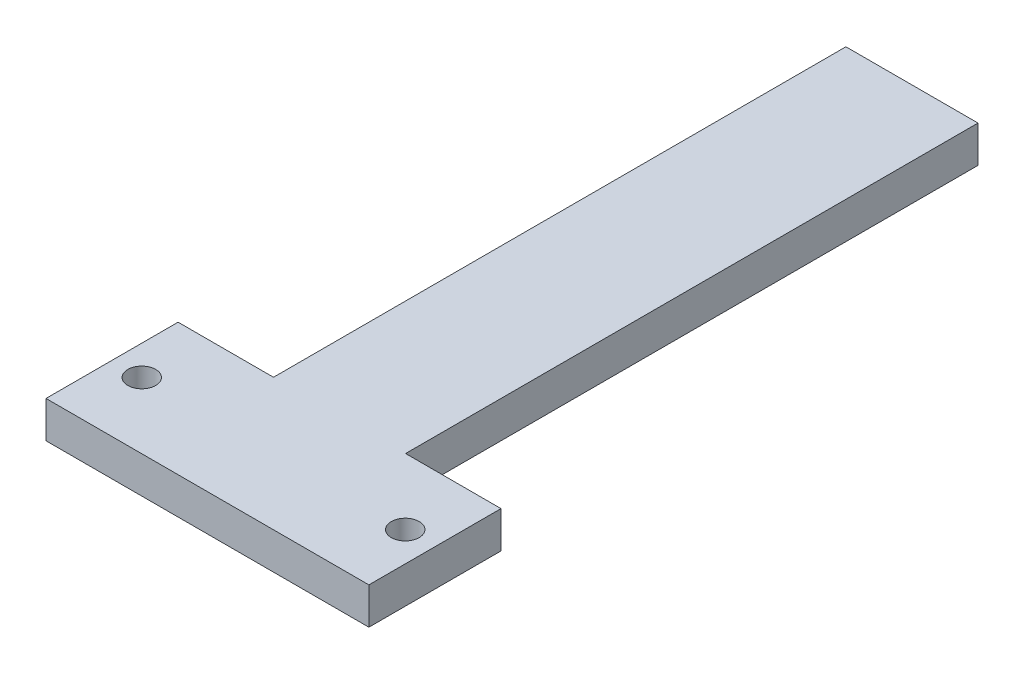
ISO-10303-21;
HEADER;
FILE_DESCRIPTION(('STEP AP214'),'2;1');
FILE_NAME('part.step','',(''),(''),'','','');
FILE_SCHEMA(('AUTOMOTIVE_DESIGN { 1 0 10303 214 1 1 1 1 }'));
ENDSEC;
DATA;
#1=APPLICATION_CONTEXT('core data for automotive mechanical design processes');
#2=APPLICATION_PROTOCOL_DEFINITION('international standard','automotive_design',2000,#1);
#3=PRODUCT_CONTEXT('',#1,'mechanical');
#4=PRODUCT('Part','Part','',(#3));
#5=PRODUCT_RELATED_PRODUCT_CATEGORY('part','',(#4));
#6=PRODUCT_DEFINITION_FORMATION('','',#4);
#7=PRODUCT_DEFINITION_CONTEXT('part definition',#1,'design');
#8=PRODUCT_DEFINITION('design','',#6,#7);
#9=PRODUCT_DEFINITION_SHAPE('','',#8);
#10=(LENGTH_UNIT() NAMED_UNIT(*) SI_UNIT(.MILLI.,.METRE.));
#11=(NAMED_UNIT(*) PLANE_ANGLE_UNIT() SI_UNIT($,.RADIAN.));
#12=(NAMED_UNIT(*) SI_UNIT($,.STERADIAN.) SOLID_ANGLE_UNIT());
#13=UNCERTAINTY_MEASURE_WITH_UNIT(LENGTH_MEASURE(1.E-05),#10,'distance_accuracy_value','');
#14=(GEOMETRIC_REPRESENTATION_CONTEXT(3) GLOBAL_UNCERTAINTY_ASSIGNED_CONTEXT((#13)) GLOBAL_UNIT_ASSIGNED_CONTEXT((#10,
#11,#12)) REPRESENTATION_CONTEXT('',''));
#15=CARTESIAN_POINT('',(0.,0.,0.));
#16=DIRECTION('',(0.,0.,1.));
#17=DIRECTION('',(1.,0.,0.));
#18=AXIS2_PLACEMENT_3D('',#15,#16,#17);
#19=CARTESIAN_POINT('',(-11.43,6.35,0.));
#20=DIRECTION('',(-1.,0.,0.));
#21=DIRECTION('',(0.,0.,1.));
#22=AXIS2_PLACEMENT_3D('',#19,#20,#21);
#23=PLANE('',#22);
#24=DIRECTION('',(0.,0.,-1.));
#25=VECTOR('',#24,1.);
#26=CARTESIAN_POINT('',(-11.43,0.,0.));
#27=LINE('',#26,#25);
#28=CARTESIAN_POINT('',(-11.43,0.,-11.43));
#29=VERTEX_POINT('',#28);
#30=CARTESIAN_POINT('',(-11.43,0.,-110.49));
#31=VERTEX_POINT('',#30);
#32=EDGE_CURVE('E142',#29,#31,#27,.T.);
#33=ORIENTED_EDGE('',*,*,#32,.F.);
#34=DIRECTION('',(0.,-1.,0.));
#35=VECTOR('',#34,1.);
#36=CARTESIAN_POINT('',(-11.43,6.35,-11.43));
#37=LINE('',#36,#35);
#38=CARTESIAN_POINT('',(-11.43,6.35,-11.43));
#39=VERTEX_POINT('',#38);
#40=EDGE_CURVE('E11',#39,#29,#37,.T.);
#41=ORIENTED_EDGE('',*,*,#40,.F.);
#42=DIRECTION('',(0.,0.,-1.));
#43=VECTOR('',#42,1.);
#44=CARTESIAN_POINT('',(-11.43,6.35,0.));
#45=LINE('',#44,#43);
#46=CARTESIAN_POINT('',(-11.43,6.35,-110.49));
#47=VERTEX_POINT('',#46);
#48=EDGE_CURVE('E166',#39,#47,#45,.T.);
#49=ORIENTED_EDGE('',*,*,#48,.T.);
#50=DIRECTION('',(0.,-1.,0.));
#51=VECTOR('',#50,1.);
#52=CARTESIAN_POINT('',(-11.43,6.35,-110.49));
#53=LINE('',#52,#51);
#54=EDGE_CURVE('E54',#47,#31,#53,.T.);
#55=ORIENTED_EDGE('',*,*,#54,.T.);
#56=EDGE_LOOP('',(#33,#41,#49,#55));
#57=FACE_BOUND('',#56,.T.);
#58=ADVANCED_FACE('F38',(#57),#23,.T.);
#59=CARTESIAN_POINT('',(0.,6.35,-11.43));
#60=DIRECTION('',(0.,0.,1.));
#61=DIRECTION('',(1.,0.,0.));
#62=AXIS2_PLACEMENT_3D('',#59,#60,#61);
#63=PLANE('',#62);
#64=DIRECTION('',(-1.,0.,0.));
#65=VECTOR('',#64,1.);
#66=CARTESIAN_POINT('',(0.,0.,-11.43));
#67=LINE('',#66,#65);
#68=CARTESIAN_POINT('',(-27.94,0.,-11.43));
#69=VERTEX_POINT('',#68);
#70=EDGE_CURVE('E144',#29,#69,#67,.T.);
#71=ORIENTED_EDGE('',*,*,#70,.T.);
#72=DIRECTION('',(0.,-1.,0.));
#73=VECTOR('',#72,1.);
#74=CARTESIAN_POINT('',(-27.94,6.35,-11.43));
#75=LINE('',#74,#73);
#76=CARTESIAN_POINT('',(-27.94,6.35,-11.43));
#77=VERTEX_POINT('',#76);
#78=EDGE_CURVE('E46',#77,#69,#75,.T.);
#79=ORIENTED_EDGE('',*,*,#78,.F.);
#80=DIRECTION('',(-1.,0.,0.));
#81=VECTOR('',#80,1.);
#82=CARTESIAN_POINT('',(0.,6.35,-11.43));
#83=LINE('',#82,#81);
#84=EDGE_CURVE('E119',#39,#77,#83,.T.);
#85=ORIENTED_EDGE('',*,*,#84,.F.);
#86=ORIENTED_EDGE('',*,*,#40,.T.);
#87=EDGE_LOOP('',(#71,#79,#85,#86));
#88=FACE_BOUND('',#87,.T.);
#89=ADVANCED_FACE('F182',(#88),#63,.F.);
#90=CARTESIAN_POINT('',(-27.94,6.35,0.));
#91=DIRECTION('',(-1.,0.,0.));
#92=DIRECTION('',(0.,0.,1.));
#93=AXIS2_PLACEMENT_3D('',#90,#91,#92);
#94=PLANE('',#93);
#95=DIRECTION('',(0.,0.,-1.));
#96=VECTOR('',#95,1.);
#97=CARTESIAN_POINT('',(-27.94,0.,0.));
#98=LINE('',#97,#96);
#99=CARTESIAN_POINT('',(-27.94,0.,11.43));
#100=VERTEX_POINT('',#99);
#101=EDGE_CURVE('E147',#100,#69,#98,.T.);
#102=ORIENTED_EDGE('',*,*,#101,.F.);
#103=DIRECTION('',(0.,-1.,0.));
#104=VECTOR('',#103,1.);
#105=CARTESIAN_POINT('',(-27.94,6.35,11.43));
#106=LINE('',#105,#104);
#107=CARTESIAN_POINT('',(-27.94,6.35,11.43));
#108=VERTEX_POINT('',#107);
#109=EDGE_CURVE('E172',#108,#100,#106,.T.);
#110=ORIENTED_EDGE('',*,*,#109,.F.);
#111=DIRECTION('',(0.,0.,-1.));
#112=VECTOR('',#111,1.);
#113=CARTESIAN_POINT('',(-27.94,6.35,0.));
#114=LINE('',#113,#112);
#115=EDGE_CURVE('E179',#108,#77,#114,.T.);
#116=ORIENTED_EDGE('',*,*,#115,.T.);
#117=ORIENTED_EDGE('',*,*,#78,.T.);
#118=EDGE_LOOP('',(#102,#110,#116,#117));
#119=FACE_BOUND('',#118,.T.);
#120=ADVANCED_FACE('F177',(#119),#94,.T.);
#121=CARTESIAN_POINT('',(0.,6.35,11.43));
#122=DIRECTION('',(0.,0.,1.));
#123=DIRECTION('',(1.,0.,0.));
#124=AXIS2_PLACEMENT_3D('',#121,#122,#123);
#125=PLANE('',#124);
#126=DIRECTION('',(-1.,0.,0.));
#127=VECTOR('',#126,1.);
#128=CARTESIAN_POINT('',(0.,0.,11.43));
#129=LINE('',#128,#127);
#130=CARTESIAN_POINT('',(27.94,0.,11.43));
#131=VERTEX_POINT('',#130);
#132=EDGE_CURVE('E150',#131,#100,#129,.T.);
#133=ORIENTED_EDGE('',*,*,#132,.F.);
#134=DIRECTION('',(0.,-1.,0.));
#135=VECTOR('',#134,1.);
#136=CARTESIAN_POINT('',(27.94,6.35,11.43));
#137=LINE('',#136,#135);
#138=CARTESIAN_POINT('',(27.94,6.35,11.43));
#139=VERTEX_POINT('',#138);
#140=EDGE_CURVE('E170',#139,#131,#137,.T.);
#141=ORIENTED_EDGE('',*,*,#140,.F.);
#142=DIRECTION('',(-1.,0.,0.));
#143=VECTOR('',#142,1.);
#144=CARTESIAN_POINT('',(0.,6.35,11.43));
#145=LINE('',#144,#143);
#146=EDGE_CURVE('E191',#139,#108,#145,.T.);
#147=ORIENTED_EDGE('',*,*,#146,.T.);
#148=ORIENTED_EDGE('',*,*,#109,.T.);
#149=EDGE_LOOP('',(#133,#141,#147,#148));
#150=FACE_BOUND('',#149,.T.);
#151=ADVANCED_FACE('F189',(#150),#125,.T.);
#152=CARTESIAN_POINT('',(27.94,6.35,0.));
#153=DIRECTION('',(-1.,0.,0.));
#154=DIRECTION('',(0.,0.,1.));
#155=AXIS2_PLACEMENT_3D('',#152,#153,#154);
#156=PLANE('',#155);
#157=DIRECTION('',(0.,0.,-1.));
#158=VECTOR('',#157,1.);
#159=CARTESIAN_POINT('',(27.94,0.,0.));
#160=LINE('',#159,#158);
#161=CARTESIAN_POINT('',(27.94,0.,-11.43));
#162=VERTEX_POINT('',#161);
#163=EDGE_CURVE('E153',#131,#162,#160,.T.);
#164=ORIENTED_EDGE('',*,*,#163,.T.);
#165=DIRECTION('',(0.,-1.,0.));
#166=VECTOR('',#165,1.);
#167=CARTESIAN_POINT('',(27.94,6.35,-11.43));
#168=LINE('',#167,#166);
#169=CARTESIAN_POINT('',(27.94,6.35,-11.43));
#170=VERTEX_POINT('',#169);
#171=EDGE_CURVE('E127',#170,#162,#168,.T.);
#172=ORIENTED_EDGE('',*,*,#171,.F.);
#173=DIRECTION('',(0.,0.,-1.));
#174=VECTOR('',#173,1.);
#175=CARTESIAN_POINT('',(27.94,6.35,0.));
#176=LINE('',#175,#174);
#177=EDGE_CURVE('E114',#139,#170,#176,.T.);
#178=ORIENTED_EDGE('',*,*,#177,.F.);
#179=ORIENTED_EDGE('',*,*,#140,.T.);
#180=EDGE_LOOP('',(#164,#172,#178,#179));
#181=FACE_BOUND('',#180,.T.);
#182=ADVANCED_FACE('F218',(#181),#156,.F.);
#183=CARTESIAN_POINT('',(11.43,0.,-11.43));
#184=VERTEX_POINT('',#183);
#185=EDGE_CURVE('E124',#162,#184,#67,.T.);
#186=ORIENTED_EDGE('',*,*,#185,.T.);
#187=DIRECTION('',(0.,-1.,0.));
#188=VECTOR('',#187,1.);
#189=CARTESIAN_POINT('',(11.43,6.35,-11.43));
#190=LINE('',#189,#188);
#191=CARTESIAN_POINT('',(11.43,6.35,-11.43));
#192=VERTEX_POINT('',#191);
#193=EDGE_CURVE('E121',#192,#184,#190,.T.);
#194=ORIENTED_EDGE('',*,*,#193,.F.);
#195=EDGE_CURVE('E104',#170,#192,#83,.T.);
#196=ORIENTED_EDGE('',*,*,#195,.F.);
#197=ORIENTED_EDGE('',*,*,#171,.T.);
#198=EDGE_LOOP('',(#186,#194,#196,#197));
#199=FACE_BOUND('',#198,.T.);
#200=ADVANCED_FACE('F122',(#199),#63,.F.);
#201=CARTESIAN_POINT('',(11.43,6.35,0.));
#202=DIRECTION('',(-1.,0.,0.));
#203=DIRECTION('',(0.,0.,1.));
#204=AXIS2_PLACEMENT_3D('',#201,#202,#203);
#205=PLANE('',#204);
#206=DIRECTION('',(0.,0.,-1.));
#207=VECTOR('',#206,1.);
#208=CARTESIAN_POINT('',(11.43,0.,0.));
#209=LINE('',#208,#207);
#210=CARTESIAN_POINT('',(11.43,0.,-110.49));
#211=VERTEX_POINT('',#210);
#212=EDGE_CURVE('E155',#184,#211,#209,.T.);
#213=ORIENTED_EDGE('',*,*,#212,.T.);
#214=DIRECTION('',(0.,-1.,0.));
#215=VECTOR('',#214,1.);
#216=CARTESIAN_POINT('',(11.43,6.35,-110.49));
#217=LINE('',#216,#215);
#218=CARTESIAN_POINT('',(11.43,6.35,-110.49));
#219=VERTEX_POINT('',#218);
#220=EDGE_CURVE('E80',#219,#211,#217,.T.);
#221=ORIENTED_EDGE('',*,*,#220,.F.);
#222=DIRECTION('',(0.,0.,-1.));
#223=VECTOR('',#222,1.);
#224=CARTESIAN_POINT('',(11.43,6.35,0.));
#225=LINE('',#224,#223);
#226=EDGE_CURVE('E111',#192,#219,#225,.T.);
#227=ORIENTED_EDGE('',*,*,#226,.F.);
#228=ORIENTED_EDGE('',*,*,#193,.T.);
#229=EDGE_LOOP('',(#213,#221,#227,#228));
#230=FACE_BOUND('',#229,.T.);
#231=ADVANCED_FACE('F129',(#230),#205,.F.);
#232=CARTESIAN_POINT('',(22.7965,6.35,0.));
#233=DIRECTION('',(0.,-1.,0.));
#234=DIRECTION('',(0.,0.,-1.));
#235=AXIS2_PLACEMENT_3D('',#232,#233,#234);
#236=CYLINDRICAL_SURFACE('',#235,2.413);
#237=CARTESIAN_POINT('',(22.7965,6.35,0.));
#238=DIRECTION('',(0.,1.,0.));
#239=DIRECTION('',(0.,0.,1.));
#240=AXIS2_PLACEMENT_3D('',#237,#238,#239);
#241=CIRCLE('',#240,2.413);
#242=CARTESIAN_POINT('',(22.7965,6.35,2.413));
#243=VERTEX_POINT('',#242);
#244=EDGE_CURVE('E132',#243,#243,#241,.T.);
#245=ORIENTED_EDGE('',*,*,#244,.T.);
#246=EDGE_LOOP('',(#245));
#247=FACE_BOUND('',#246,.T.);
#248=CARTESIAN_POINT('',(22.7965,0.,0.));
#249=DIRECTION('',(0.,1.,0.));
#250=DIRECTION('',(0.,0.,1.));
#251=AXIS2_PLACEMENT_3D('',#248,#249,#250);
#252=CIRCLE('',#251,2.413);
#253=CARTESIAN_POINT('',(22.7965,0.,2.413));
#254=VERTEX_POINT('',#253);
#255=EDGE_CURVE('E160',#254,#254,#252,.T.);
#256=ORIENTED_EDGE('',*,*,#255,.F.);
#257=EDGE_LOOP('',(#256));
#258=FACE_BOUND('',#257,.T.);
#259=ADVANCED_FACE('F197',(#247,#258),#236,.F.);
#260=CARTESIAN_POINT('',(0.,6.35,-110.49));
#261=DIRECTION('',(0.,0.,-1.));
#262=DIRECTION('',(-1.,0.,0.));
#263=AXIS2_PLACEMENT_3D('',#260,#261,#262);
#264=PLANE('',#263);
#265=DIRECTION('',(1.,0.,0.));
#266=VECTOR('',#265,1.);
#267=CARTESIAN_POINT('',(0.,0.,-110.49));
#268=LINE('',#267,#266);
#269=EDGE_CURVE('E157',#31,#211,#268,.T.);
#270=ORIENTED_EDGE('',*,*,#269,.F.);
#271=ORIENTED_EDGE('',*,*,#54,.F.);
#272=DIRECTION('',(1.,0.,0.));
#273=VECTOR('',#272,1.);
#274=CARTESIAN_POINT('',(0.,6.35,-110.49));
#275=LINE('',#274,#273);
#276=EDGE_CURVE('E130',#47,#219,#275,.T.);
#277=ORIENTED_EDGE('',*,*,#276,.T.);
#278=ORIENTED_EDGE('',*,*,#220,.T.);
#279=EDGE_LOOP('',(#270,#271,#277,#278));
#280=FACE_BOUND('',#279,.T.);
#281=ADVANCED_FACE('F194',(#280),#264,.T.);
#282=CARTESIAN_POINT('',(-22.7965,6.35,0.));
#283=DIRECTION('',(0.,-1.,0.));
#284=DIRECTION('',(0.,0.,-1.));
#285=AXIS2_PLACEMENT_3D('',#282,#283,#284);
#286=CYLINDRICAL_SURFACE('',#285,2.413);
#287=CARTESIAN_POINT('',(-22.7965,6.35,0.));
#288=DIRECTION('',(0.,1.,0.));
#289=DIRECTION('',(0.,0.,1.));
#290=AXIS2_PLACEMENT_3D('',#287,#288,#289);
#291=CIRCLE('',#290,2.413);
#292=CARTESIAN_POINT('',(-22.7965,6.35,2.413));
#293=VERTEX_POINT('',#292);
#294=EDGE_CURVE('E139',#293,#293,#291,.T.);
#295=ORIENTED_EDGE('',*,*,#294,.T.);
#296=EDGE_LOOP('',(#295));
#297=FACE_BOUND('',#296,.T.);
#298=CARTESIAN_POINT('',(-22.7965,0.,0.));
#299=DIRECTION('',(0.,1.,0.));
#300=DIRECTION('',(0.,0.,1.));
#301=AXIS2_PLACEMENT_3D('',#298,#299,#300);
#302=CIRCLE('',#301,2.413);
#303=CARTESIAN_POINT('',(-22.7965,0.,2.413));
#304=VERTEX_POINT('',#303);
#305=EDGE_CURVE('E163',#304,#304,#302,.T.);
#306=ORIENTED_EDGE('',*,*,#305,.F.);
#307=EDGE_LOOP('',(#306));
#308=FACE_BOUND('',#307,.T.);
#309=ADVANCED_FACE('F196',(#297,#308),#286,.F.);
#310=CARTESIAN_POINT('',(0.,6.35,0.));
#311=DIRECTION('',(0.,1.,0.));
#312=DIRECTION('',(0.,0.,1.));
#313=AXIS2_PLACEMENT_3D('',#310,#311,#312);
#314=PLANE('',#313);
#315=ORIENTED_EDGE('',*,*,#48,.F.);
#316=ORIENTED_EDGE('',*,*,#84,.T.);
#317=ORIENTED_EDGE('',*,*,#115,.F.);
#318=ORIENTED_EDGE('',*,*,#146,.F.);
#319=ORIENTED_EDGE('',*,*,#177,.T.);
#320=ORIENTED_EDGE('',*,*,#195,.T.);
#321=ORIENTED_EDGE('',*,*,#226,.T.);
#322=ORIENTED_EDGE('',*,*,#276,.F.);
#323=EDGE_LOOP('',(#315,#316,#317,#318,#319,#320,#321,#322));
#324=FACE_BOUND('',#323,.T.);
#325=ORIENTED_EDGE('',*,*,#244,.F.);
#326=EDGE_LOOP('',(#325));
#327=FACE_BOUND('',#326,.T.);
#328=ORIENTED_EDGE('',*,*,#294,.F.);
#329=EDGE_LOOP('',(#328));
#330=FACE_BOUND('',#329,.T.);
#331=ADVANCED_FACE('F107',(#324,#327,#330),#314,.T.);
#332=CARTESIAN_POINT('',(0.,0.,0.));
#333=DIRECTION('',(0.,1.,0.));
#334=DIRECTION('',(0.,0.,1.));
#335=AXIS2_PLACEMENT_3D('',#332,#333,#334);
#336=PLANE('',#335);
#337=ORIENTED_EDGE('',*,*,#32,.T.);
#338=ORIENTED_EDGE('',*,*,#269,.T.);
#339=ORIENTED_EDGE('',*,*,#212,.F.);
#340=ORIENTED_EDGE('',*,*,#185,.F.);
#341=ORIENTED_EDGE('',*,*,#163,.F.);
#342=ORIENTED_EDGE('',*,*,#132,.T.);
#343=ORIENTED_EDGE('',*,*,#101,.T.);
#344=ORIENTED_EDGE('',*,*,#70,.F.);
#345=EDGE_LOOP('',(#337,#338,#339,#340,#341,#342,#343,#344));
#346=FACE_BOUND('',#345,.T.);
#347=ORIENTED_EDGE('',*,*,#255,.T.);
#348=EDGE_LOOP('',(#347));
#349=FACE_BOUND('',#348,.T.);
#350=ORIENTED_EDGE('',*,*,#305,.T.);
#351=EDGE_LOOP('',(#350));
#352=FACE_BOUND('',#351,.T.);
#353=ADVANCED_FACE('F184',(#346,#349,#352),#336,.F.);
#354=CLOSED_SHELL('',(#58,#89,#120,#151,#182,#200,#231,#259,#281,#309,#331,#353));
#355=MANIFOLD_SOLID_BREP('B2',#354);
#356=ADVANCED_BREP_SHAPE_REPRESENTATION('',(#18,#355),#14);
#357=SHAPE_DEFINITION_REPRESENTATION(#9,#356);
ENDSEC;
END-ISO-10303-21;
